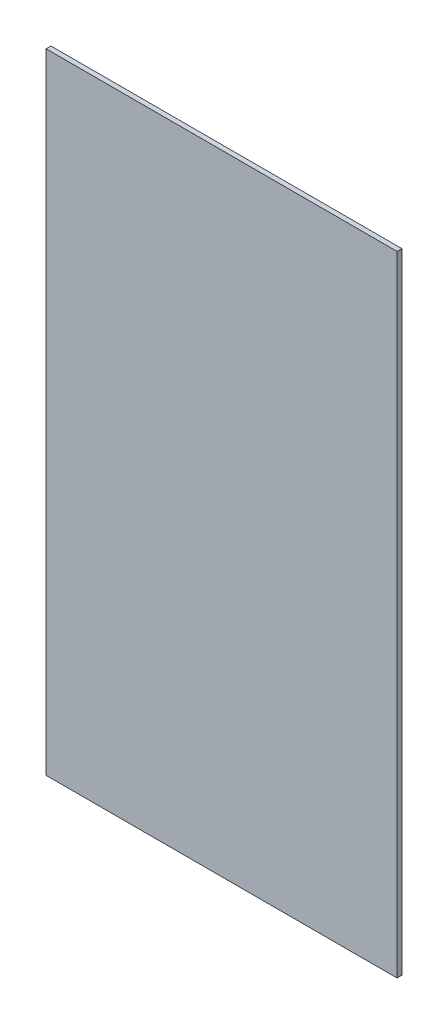
ISO-10303-21;
HEADER;
FILE_DESCRIPTION(('STEP AP214'),'2;1');
FILE_NAME('part.step','',(''),(''),'','','');
FILE_SCHEMA(('AUTOMOTIVE_DESIGN { 1 0 10303 214 1 1 1 1 }'));
ENDSEC;
DATA;
#1=APPLICATION_CONTEXT('core data for automotive mechanical design processes');
#2=APPLICATION_PROTOCOL_DEFINITION('international standard','automotive_design',2000,#1);
#3=PRODUCT_CONTEXT('',#1,'mechanical');
#4=PRODUCT('Part','Part','',(#3));
#5=PRODUCT_RELATED_PRODUCT_CATEGORY('part','',(#4));
#6=PRODUCT_DEFINITION_FORMATION('','',#4);
#7=PRODUCT_DEFINITION_CONTEXT('part definition',#1,'design');
#8=PRODUCT_DEFINITION('design','',#6,#7);
#9=PRODUCT_DEFINITION_SHAPE('','',#8);
#10=(LENGTH_UNIT() NAMED_UNIT(*) SI_UNIT(.MILLI.,.METRE.));
#11=(NAMED_UNIT(*) PLANE_ANGLE_UNIT() SI_UNIT($,.RADIAN.));
#12=(NAMED_UNIT(*) SI_UNIT($,.STERADIAN.) SOLID_ANGLE_UNIT());
#13=UNCERTAINTY_MEASURE_WITH_UNIT(LENGTH_MEASURE(1.E-05),#10,'distance_accuracy_value','');
#14=(GEOMETRIC_REPRESENTATION_CONTEXT(3) GLOBAL_UNCERTAINTY_ASSIGNED_CONTEXT((#13)) GLOBAL_UNIT_ASSIGNED_CONTEXT((#10,
#11,#12)) REPRESENTATION_CONTEXT('',''));
#15=CARTESIAN_POINT('',(0.,0.,0.));
#16=DIRECTION('',(0.,0.,1.));
#17=DIRECTION('',(1.,0.,0.));
#18=AXIS2_PLACEMENT_3D('',#15,#16,#17);
#19=CARTESIAN_POINT('',(-19.2733943507042,50.1336969127035,0.127));
#20=DIRECTION('',(1.,0.,0.));
#21=DIRECTION('',(0.,0.,-1.));
#22=AXIS2_PLACEMENT_3D('',#19,#20,#21);
#23=PLANE('',#22);
#24=DIRECTION('',(0.,-1.,0.));
#25=VECTOR('',#24,1.);
#26=CARTESIAN_POINT('',(-19.2733943507042,50.1336969127035,0.));
#27=LINE('',#26,#25);
#28=CARTESIAN_POINT('',(-19.2733943507042,50.1336969127035,0.));
#29=VERTEX_POINT('',#28);
#30=CARTESIAN_POINT('',(-19.2733943507042,33.6236969127037,0.));
#31=VERTEX_POINT('',#30);
#32=EDGE_CURVE('E95',#29,#31,#27,.T.);
#33=ORIENTED_EDGE('',*,*,#32,.T.);
#34=DIRECTION('',(0.,0.,-1.));
#35=VECTOR('',#34,1.);
#36=CARTESIAN_POINT('',(-19.2733943507042,33.6236969127037,0.127));
#37=LINE('',#36,#35);
#38=CARTESIAN_POINT('',(-19.2733943507042,33.6236969127037,0.127));
#39=VERTEX_POINT('',#38);
#40=EDGE_CURVE('E11',#39,#31,#37,.T.);
#41=ORIENTED_EDGE('',*,*,#40,.F.);
#42=DIRECTION('',(0.,-1.,0.));
#43=VECTOR('',#42,1.);
#44=CARTESIAN_POINT('',(-19.2733943507042,50.1336969127035,0.127));
#45=LINE('',#44,#43);
#46=CARTESIAN_POINT('',(-19.2733943507042,50.1336969127035,0.127));
#47=VERTEX_POINT('',#46);
#48=EDGE_CURVE('E83',#47,#39,#45,.T.);
#49=ORIENTED_EDGE('',*,*,#48,.F.);
#50=DIRECTION('',(0.,0.,-1.));
#51=VECTOR('',#50,1.);
#52=CARTESIAN_POINT('',(-19.2733943507042,50.1336969127035,0.127));
#53=LINE('',#52,#51);
#54=EDGE_CURVE('E91',#47,#29,#53,.T.);
#55=ORIENTED_EDGE('',*,*,#54,.T.);
#56=EDGE_LOOP('',(#33,#41,#49,#55));
#57=FACE_BOUND('',#56,.T.);
#58=ADVANCED_FACE('F32',(#57),#23,.F.);
#59=CARTESIAN_POINT('',(-19.2733943507042,33.6236969127037,0.127));
#60=DIRECTION('',(0.,1.,0.));
#61=DIRECTION('',(0.,0.,1.));
#62=AXIS2_PLACEMENT_3D('',#59,#60,#61);
#63=PLANE('',#62);
#64=DIRECTION('',(1.,0.,0.));
#65=VECTOR('',#64,1.);
#66=CARTESIAN_POINT('',(-19.2733943507042,33.6236969127037,0.));
#67=LINE('',#66,#65);
#68=CARTESIAN_POINT('',(-10.0658943507042,33.6236969127037,0.));
#69=VERTEX_POINT('',#68);
#70=EDGE_CURVE('E87',#31,#69,#67,.T.);
#71=ORIENTED_EDGE('',*,*,#70,.T.);
#72=DIRECTION('',(0.,0.,-1.));
#73=VECTOR('',#72,1.);
#74=CARTESIAN_POINT('',(-10.0658943507042,33.6236969127037,0.127));
#75=LINE('',#74,#73);
#76=CARTESIAN_POINT('',(-10.0658943507042,33.6236969127037,0.127));
#77=VERTEX_POINT('',#76);
#78=EDGE_CURVE('E40',#77,#69,#75,.T.);
#79=ORIENTED_EDGE('',*,*,#78,.F.);
#80=DIRECTION('',(1.,0.,0.));
#81=VECTOR('',#80,1.);
#82=CARTESIAN_POINT('',(-19.2733943507042,33.6236969127037,0.127));
#83=LINE('',#82,#81);
#84=EDGE_CURVE('E78',#39,#77,#83,.T.);
#85=ORIENTED_EDGE('',*,*,#84,.F.);
#86=ORIENTED_EDGE('',*,*,#40,.T.);
#87=EDGE_LOOP('',(#71,#79,#85,#86));
#88=FACE_BOUND('',#87,.T.);
#89=ADVANCED_FACE('F86',(#88),#63,.F.);
#90=CARTESIAN_POINT('',(-10.0658943507042,33.6236969127037,0.127));
#91=DIRECTION('',(-1.,0.,0.));
#92=DIRECTION('',(0.,0.,1.));
#93=AXIS2_PLACEMENT_3D('',#90,#91,#92);
#94=PLANE('',#93);
#95=DIRECTION('',(0.,1.,0.));
#96=VECTOR('',#95,1.);
#97=CARTESIAN_POINT('',(-10.0658943507042,33.6236969127037,0.));
#98=LINE('',#97,#96);
#99=CARTESIAN_POINT('',(-10.0658943507042,50.1336969127035,0.));
#100=VERTEX_POINT('',#99);
#101=EDGE_CURVE('E65',#69,#100,#98,.T.);
#102=ORIENTED_EDGE('',*,*,#101,.T.);
#103=DIRECTION('',(0.,0.,-1.));
#104=VECTOR('',#103,1.);
#105=CARTESIAN_POINT('',(-10.0658943507042,50.1336969127035,0.127));
#106=LINE('',#105,#104);
#107=CARTESIAN_POINT('',(-10.0658943507042,50.1336969127035,0.127));
#108=VERTEX_POINT('',#107);
#109=EDGE_CURVE('E88',#108,#100,#106,.T.);
#110=ORIENTED_EDGE('',*,*,#109,.F.);
#111=DIRECTION('',(0.,1.,0.));
#112=VECTOR('',#111,1.);
#113=CARTESIAN_POINT('',(-10.0658943507042,33.6236969127037,0.127));
#114=LINE('',#113,#112);
#115=EDGE_CURVE('E81',#77,#108,#114,.T.);
#116=ORIENTED_EDGE('',*,*,#115,.F.);
#117=ORIENTED_EDGE('',*,*,#78,.T.);
#118=EDGE_LOOP('',(#102,#110,#116,#117));
#119=FACE_BOUND('',#118,.T.);
#120=ADVANCED_FACE('F89',(#119),#94,.F.);
#121=CARTESIAN_POINT('',(-10.0658943507042,50.1336969127035,0.127));
#122=DIRECTION('',(0.,-1.,0.));
#123=DIRECTION('',(0.,0.,-1.));
#124=AXIS2_PLACEMENT_3D('',#121,#122,#123);
#125=PLANE('',#124);
#126=DIRECTION('',(-1.,0.,0.));
#127=VECTOR('',#126,1.);
#128=CARTESIAN_POINT('',(-10.0658943507042,50.1336969127035,0.));
#129=LINE('',#128,#127);
#130=EDGE_CURVE('E71',#100,#29,#129,.T.);
#131=ORIENTED_EDGE('',*,*,#130,.T.);
#132=ORIENTED_EDGE('',*,*,#54,.F.);
#133=DIRECTION('',(-1.,0.,0.));
#134=VECTOR('',#133,1.);
#135=CARTESIAN_POINT('',(-10.0658943507042,50.1336969127035,0.127));
#136=LINE('',#135,#134);
#137=EDGE_CURVE('E48',#108,#47,#136,.T.);
#138=ORIENTED_EDGE('',*,*,#137,.F.);
#139=ORIENTED_EDGE('',*,*,#109,.T.);
#140=EDGE_LOOP('',(#131,#132,#138,#139));
#141=FACE_BOUND('',#140,.T.);
#142=ADVANCED_FACE('F102',(#141),#125,.F.);
#143=CARTESIAN_POINT('',(0.,0.,0.127));
#144=DIRECTION('',(0.,0.,1.));
#145=DIRECTION('',(1.,0.,0.));
#146=AXIS2_PLACEMENT_3D('',#143,#144,#145);
#147=PLANE('',#146);
#148=ORIENTED_EDGE('',*,*,#48,.T.);
#149=ORIENTED_EDGE('',*,*,#84,.T.);
#150=ORIENTED_EDGE('',*,*,#115,.T.);
#151=ORIENTED_EDGE('',*,*,#137,.T.);
#152=EDGE_LOOP('',(#148,#149,#150,#151));
#153=FACE_BOUND('',#152,.T.);
#154=ADVANCED_FACE('F79',(#153),#147,.T.);
#155=CARTESIAN_POINT('',(0.,0.,0.));
#156=DIRECTION('',(0.,0.,1.));
#157=DIRECTION('',(1.,0.,0.));
#158=AXIS2_PLACEMENT_3D('',#155,#156,#157);
#159=PLANE('',#158);
#160=ORIENTED_EDGE('',*,*,#32,.F.);
#161=ORIENTED_EDGE('',*,*,#130,.F.);
#162=ORIENTED_EDGE('',*,*,#101,.F.);
#163=ORIENTED_EDGE('',*,*,#70,.F.);
#164=EDGE_LOOP('',(#160,#161,#162,#163));
#165=FACE_BOUND('',#164,.T.);
#166=ADVANCED_FACE('F105',(#165),#159,.F.);
#167=CLOSED_SHELL('',(#58,#89,#120,#142,#154,#166));
#168=MANIFOLD_SOLID_BREP('B2',#167);
#169=ADVANCED_BREP_SHAPE_REPRESENTATION('',(#18,#168),#14);
#170=SHAPE_DEFINITION_REPRESENTATION(#9,#169);
ENDSEC;
END-ISO-10303-21;
